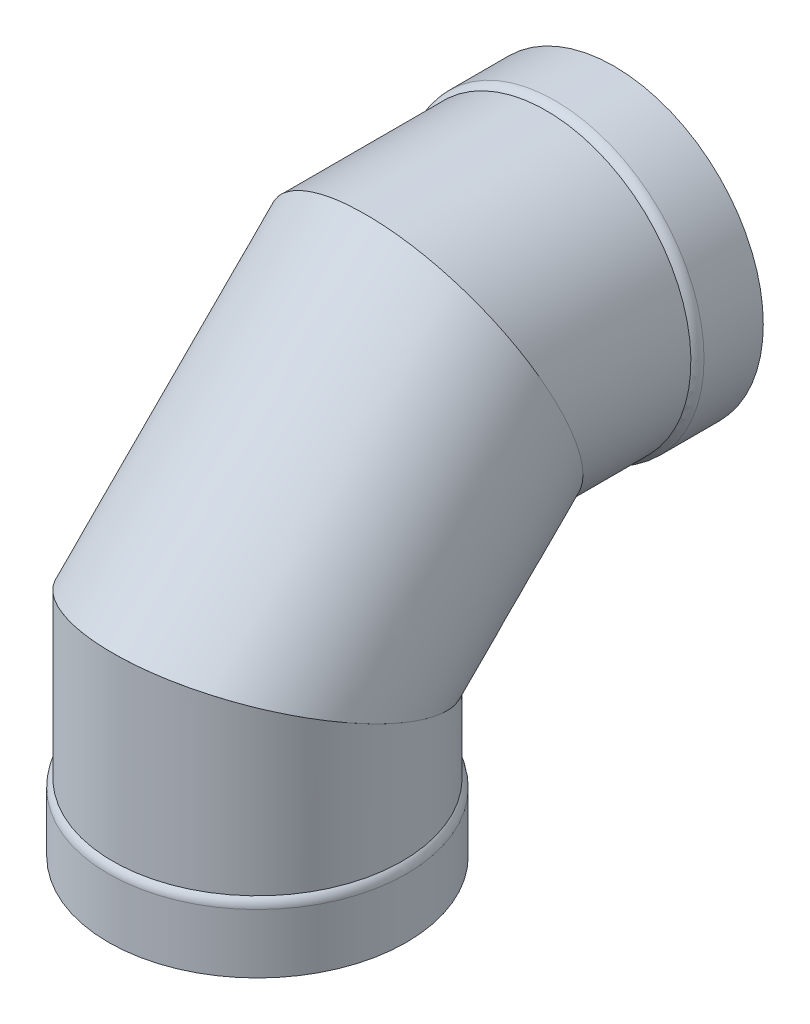
ISO-10303-21;
HEADER;
FILE_DESCRIPTION(('STEP AP214'),'2;1');
FILE_NAME('part.step','',(''),(''),'','','');
FILE_SCHEMA(('AUTOMOTIVE_DESIGN { 1 0 10303 214 1 1 1 1 }'));
ENDSEC;
DATA;
#1=APPLICATION_CONTEXT('core data for automotive mechanical design processes');
#2=APPLICATION_PROTOCOL_DEFINITION('international standard','automotive_design',2000,#1);
#3=PRODUCT_CONTEXT('',#1,'mechanical');
#4=PRODUCT('Part','Part','',(#3));
#5=PRODUCT_RELATED_PRODUCT_CATEGORY('part','',(#4));
#6=PRODUCT_DEFINITION_FORMATION('','',#4);
#7=PRODUCT_DEFINITION_CONTEXT('part definition',#1,'design');
#8=PRODUCT_DEFINITION('design','',#6,#7);
#9=PRODUCT_DEFINITION_SHAPE('','',#8);
#10=(LENGTH_UNIT() NAMED_UNIT(*) SI_UNIT(.MILLI.,.METRE.));
#11=(NAMED_UNIT(*) PLANE_ANGLE_UNIT() SI_UNIT($,.RADIAN.));
#12=(NAMED_UNIT(*) SI_UNIT($,.STERADIAN.) SOLID_ANGLE_UNIT());
#13=UNCERTAINTY_MEASURE_WITH_UNIT(LENGTH_MEASURE(1.E-05),#10,'distance_accuracy_value','');
#14=(GEOMETRIC_REPRESENTATION_CONTEXT(3) GLOBAL_UNCERTAINTY_ASSIGNED_CONTEXT((#13)) GLOBAL_UNIT_ASSIGNED_CONTEXT((#10,
#11,#12)) REPRESENTATION_CONTEXT('',''));
#15=CARTESIAN_POINT('',(0.,0.,0.));
#16=DIRECTION('',(0.,0.,1.));
#17=DIRECTION('',(1.,0.,0.));
#18=AXIS2_PLACEMENT_3D('',#15,#16,#17);
#19=CARTESIAN_POINT('',(0.,399.091863905325,-188.748113905325));
#20=DIRECTION('',(0.,-0.384615384615388,0.923076923076921));
#21=DIRECTION('',(0.,-0.923076923076921,-0.384615384615388));
#22=AXIS2_PLACEMENT_3D('',#19,#20,#21);
#23=PLANE('',#22);
#24=CARTESIAN_POINT('',(0.,399.091863905325,-188.748113905325));
#25=DIRECTION('',(0.,-0.384615384615388,0.923076923076921));
#26=DIRECTION('',(0.,-0.923076923076921,-0.384615384615388));
#27=AXIS2_PLACEMENT_3D('',#24,#25,#26);
#28=ELLIPSE('',#27,170.259375,157.1625);
#29=CARTESIAN_POINT('',(0.,241.929363905326,-254.232488905325));
#30=VERTEX_POINT('',#29);
#31=EDGE_CURVE('E91',#30,#30,#28,.T.);
#32=ORIENTED_EDGE('',*,*,#31,.T.);
#33=EDGE_LOOP('',(#32));
#34=FACE_BOUND('',#33,.T.);
#35=CARTESIAN_POINT('',(0.,399.091863905325,-188.748113905325));
#36=DIRECTION('',(0.,-0.384615384615388,0.923076923076921));
#37=DIRECTION('',(0.,-0.923076923076921,-0.384615384615388));
#38=AXIS2_PLACEMENT_3D('',#35,#36,#37);
#39=ELLIPSE('',#38,175.41875,161.925);
#40=CARTESIAN_POINT('',(0.,237.166863905326,-256.216863905325));
#41=VERTEX_POINT('',#40);
#42=EDGE_CURVE('E12',#41,#41,#39,.T.);
#43=ORIENTED_EDGE('',*,*,#42,.F.);
#44=EDGE_LOOP('',(#43));
#45=FACE_BOUND('',#44,.T.);
#46=ADVANCED_FACE('F74',(#34,#45),#23,.F.);
#47=CARTESIAN_POINT('',(0.,210.34375,0.));
#48=DIRECTION('',(0.,0.923076923076923,-0.384615384615385));
#49=DIRECTION('',(0.,0.384615384615385,0.923076923076923));
#50=AXIS2_PLACEMENT_3D('',#47,#48,#49);
#51=PLANE('',#50);
#52=CARTESIAN_POINT('',(0.,210.34375,0.));
#53=DIRECTION('',(0.,0.923076923076923,-0.384615384615385));
#54=DIRECTION('',(0.,-0.384615384615385,-0.923076923076923));
#55=AXIS2_PLACEMENT_3D('',#52,#53,#54);
#56=ELLIPSE('',#55,170.259375,157.1625);
#57=CARTESIAN_POINT('',(0.,144.859375,-157.1625));
#58=VERTEX_POINT('',#57);
#59=EDGE_CURVE('E105',#58,#58,#56,.T.);
#60=ORIENTED_EDGE('',*,*,#59,.T.);
#61=EDGE_LOOP('',(#60));
#62=FACE_BOUND('',#61,.T.);
#63=CARTESIAN_POINT('',(0.,210.34375,0.));
#64=DIRECTION('',(0.,0.923076923076923,-0.384615384615385));
#65=DIRECTION('',(0.,-0.384615384615385,-0.923076923076923));
#66=AXIS2_PLACEMENT_3D('',#63,#64,#65);
#67=ELLIPSE('',#66,175.41875,161.925);
#68=CARTESIAN_POINT('',(0.,142.875,-161.925));
#69=VERTEX_POINT('',#68);
#70=EDGE_CURVE('E83',#69,#69,#67,.T.);
#71=ORIENTED_EDGE('',*,*,#70,.F.);
#72=EDGE_LOOP('',(#71));
#73=FACE_BOUND('',#72,.T.);
#74=ADVANCED_FACE('F113',(#62,#73),#51,.F.);
#75=CARTESIAN_POINT('',(0.0202913043601244,277.812499470258,161.924998728618));
#76=CARTESIAN_POINT('',(0.0652137582658417,561.016850773213,-121.279369377037));
#77=CARTESIAN_POINT('',(323.870288761596,277.795590049958,161.884416119898));
#78=CARTESIAN_POINT('',(323.915187494042,560.886423256681,-121.333714175592));
#79=CARTESIAN_POINT('',(323.829706152876,142.858091109442,-161.965581337339));
#80=CARTESIAN_POINT('',(323.78475997751,237.036449520906,-256.271203232167));
#81=CARTESIAN_POINT('',(-0.0202913043602162,142.875000529742,-161.924998728618));
#82=CARTESIAN_POINT('',(-0.0652137582658615,237.166877037437,-256.216858433612));
#83=CARTESIAN_POINT('',(-323.870288761596,142.891909950043,-161.884416119898));
#84=CARTESIAN_POINT('',(-323.915187494042,237.297304553969,-256.162513635057));
#85=CARTESIAN_POINT('',(-323.829706152876,277.829408890558,161.965581337338));
#86=CARTESIAN_POINT('',(-323.78475997751,561.147278289745,-121.225024578482));
#87=CARTESIAN_POINT('',(0.0202913043601244,277.812499470258,161.924998728618));
#88=CARTESIAN_POINT('',(0.0652137582658417,561.016850773213,-121.279369377037));
#89=(BOUNDED_SURFACE() B_SPLINE_SURFACE(3,1,((#75,#76),(#77,#78),(#79,#80),(#81,#82),(#83,#84),
(#85,#86),(#87,#88)),.UNSPECIFIED.,.T.,.F.,.F.) B_SPLINE_SURFACE_WITH_KNOTS((4,3,4),(2,2),(0.,
0.5,1.),(0.,1.),.UNSPECIFIED.) GEOMETRIC_REPRESENTATION_ITEM() RATIONAL_B_SPLINE_SURFACE(((1.,
1.),(0.333333333333333,0.333333333333333),(0.333333333333333,0.333333333333333),(1.,1.),
(0.333333333333333,0.333333333333333),(0.333333333333333,0.333333333333333),(1.,1.))) REPRESENTATION_ITEM('') SURFACE());
#90=ORIENTED_EDGE('',*,*,#70,.T.);
#91=EDGE_LOOP('',(#90));
#92=FACE_BOUND('',#91,.T.);
#93=ORIENTED_EDGE('',*,*,#42,.T.);
#94=EDGE_LOOP('',(#93));
#95=FACE_BOUND('',#94,.T.);
#96=ADVANCED_FACE('F133',(#92,#95),#89,.T.);
#97=CARTESIAN_POINT('',(0.,144.859375,-157.1625));
#98=CARTESIAN_POINT('',(0.,241.929363905326,-254.232488905325));
#99=CARTESIAN_POINT('',(-314.325,144.859375,-157.1625));
#100=CARTESIAN_POINT('',(-314.325,241.929363905326,-254.232488905325));
#101=CARTESIAN_POINT('',(-314.325,275.828125,157.1625));
#102=CARTESIAN_POINT('',(-314.325,556.254363905325,-123.263738905324));
#103=CARTESIAN_POINT('',(0.,275.828125,157.1625));
#104=CARTESIAN_POINT('',(0.,556.254363905325,-123.263738905324));
#105=CARTESIAN_POINT('',(314.325,275.828125,157.1625));
#106=CARTESIAN_POINT('',(314.325,556.254363905325,-123.263738905324));
#107=CARTESIAN_POINT('',(314.325,144.859375,-157.1625));
#108=CARTESIAN_POINT('',(314.325,241.929363905326,-254.232488905325));
#109=CARTESIAN_POINT('',(0.,144.859375,-157.1625));
#110=CARTESIAN_POINT('',(0.,241.929363905326,-254.232488905325));
#111=(BOUNDED_SURFACE() B_SPLINE_SURFACE(3,1,((#97,#98),(#99,#100),(#101,#102),(#103,#104),
(#105,#106),(#107,#108),(#109,#110)),.UNSPECIFIED.,.T.,.F.,.F.) B_SPLINE_SURFACE_WITH_KNOTS((4,
3,4),(2,2),(0.,0.5,1.),(0.,1.),
.UNSPECIFIED.) GEOMETRIC_REPRESENTATION_ITEM() RATIONAL_B_SPLINE_SURFACE(((1.,1.),
(0.333333333333333,0.333333333333333),(0.333333333333333,0.333333333333333),(1.,1.),
(0.333333333333333,0.333333333333333),(0.333333333333333,0.333333333333333),(1.,1.))) REPRESENTATION_ITEM('') SURFACE());
#112=ORIENTED_EDGE('',*,*,#59,.F.);
#113=EDGE_LOOP('',(#112));
#114=FACE_BOUND('',#113,.T.);
#115=ORIENTED_EDGE('',*,*,#31,.F.);
#116=EDGE_LOOP('',(#115));
#117=FACE_BOUND('',#116,.T.);
#118=ADVANCED_FACE('F134',(#114,#117),#111,.F.);
#119=CLOSED_SHELL('',(#46,#74,#96,#118));
#120=MANIFOLD_SOLID_BREP('B2',#119);
#121=CARTESIAN_POINT('',(0.,399.091863905326,-451.205657008773));
#122=DIRECTION('',(0.,0.,-1.));
#123=DIRECTION('',(0.,-1.,0.));
#124=AXIS2_PLACEMENT_3D('',#121,#122,#123);
#125=CYLINDRICAL_SURFACE('',#124,161.925);
#126=CARTESIAN_POINT('',(0.,399.091863905326,-322.891863905325));
#127=DIRECTION('',(0.,0.,1.));
#128=DIRECTION('',(0.,-1.,0.));
#129=AXIS2_PLACEMENT_3D('',#126,#127,#128);
#130=CIRCLE('',#129,161.925);
#131=CARTESIAN_POINT('',(0.,237.166863905326,-322.891863905325));
#132=VERTEX_POINT('',#131);
#133=EDGE_CURVE('E275',#132,#132,#130,.T.);
#134=ORIENTED_EDGE('',*,*,#133,.T.);
#135=EDGE_LOOP('',(#134));
#136=FACE_BOUND('',#135,.T.);
#137=CARTESIAN_POINT('',(0.,399.091863905325,-188.748113905325));
#138=DIRECTION('',(0.,-0.384615384615388,0.923076923076922));
#139=DIRECTION('',(0.,-0.923076923076921,-0.384615384615388));
#140=AXIS2_PLACEMENT_3D('',#137,#138,#139);
#141=ELLIPSE('',#140,175.41875,161.925);
#142=CARTESIAN_POINT('',(0.,237.166863905326,-256.216863905325));
#143=VERTEX_POINT('',#142);
#144=EDGE_CURVE('E287',#143,#143,#141,.T.);
#145=ORIENTED_EDGE('',*,*,#144,.F.);
#146=EDGE_LOOP('',(#145));
#147=FACE_BOUND('',#146,.T.);
#148=ADVANCED_FACE('F261',(#136,#147),#125,.T.);
#149=CARTESIAN_POINT('',(0.,399.091863905326,-451.205657008773));
#150=DIRECTION('',(0.,0.,-1.));
#151=DIRECTION('',(0.,-1.,0.));
#152=AXIS2_PLACEMENT_3D('',#149,#150,#151);
#153=CYLINDRICAL_SURFACE('',#152,166.6875);
#154=CARTESIAN_POINT('',(0.,399.091863905326,-332.805798227782));
#155=DIRECTION('',(0.,0.,1.));
#156=DIRECTION('',(0.,-1.,0.));
#157=AXIS2_PLACEMENT_3D('',#154,#155,#156);
#158=CIRCLE('',#157,166.6875);
#159=CARTESIAN_POINT('',(0.,232.404363905326,-332.805798227783));
#160=VERTEX_POINT('',#159);
#161=EDGE_CURVE('E269',#160,#160,#158,.F.);
#162=ORIENTED_EDGE('',*,*,#161,.T.);
#163=EDGE_LOOP('',(#162));
#164=FACE_BOUND('',#163,.T.);
#165=CARTESIAN_POINT('',(0.,399.091863905326,-399.091863905325));
#166=DIRECTION('',(0.,0.,1.));
#167=DIRECTION('',(0.,-1.,0.));
#168=AXIS2_PLACEMENT_3D('',#165,#166,#167);
#169=CIRCLE('',#168,166.6875);
#170=CARTESIAN_POINT('',(0.,232.404363905326,-399.091863905325));
#171=VERTEX_POINT('',#170);
#172=EDGE_CURVE('E281',#171,#171,#169,.T.);
#173=ORIENTED_EDGE('',*,*,#172,.T.);
#174=EDGE_LOOP('',(#173));
#175=FACE_BOUND('',#174,.T.);
#176=ADVANCED_FACE('F308',(#164,#175),#153,.T.);
#177=CARTESIAN_POINT('',(0.,565.779363905326,-399.091863905324));
#178=DIRECTION('',(0.,0.,1.));
#179=DIRECTION('',(0.,1.,0.));
#180=AXIS2_PLACEMENT_3D('',#177,#178,#179);
#181=PLANE('',#180);
#182=CARTESIAN_POINT('',(0.,399.091863905326,-399.091863905325));
#183=DIRECTION('',(0.,0.,1.));
#184=DIRECTION('',(0.,-1.,0.));
#185=AXIS2_PLACEMENT_3D('',#182,#183,#184);
#186=CIRCLE('',#185,161.925);
#187=CARTESIAN_POINT('',(0.,237.166863905326,-399.091863905325));
#188=VERTEX_POINT('',#187);
#189=EDGE_CURVE('E292',#188,#188,#186,.T.);
#190=ORIENTED_EDGE('',*,*,#189,.T.);
#191=EDGE_LOOP('',(#190));
#192=FACE_BOUND('',#191,.T.);
#193=ORIENTED_EDGE('',*,*,#172,.F.);
#194=EDGE_LOOP('',(#193));
#195=FACE_BOUND('',#194,.T.);
#196=ADVANCED_FACE('F314',(#192,#195),#181,.F.);
#197=CARTESIAN_POINT('',(0.,399.091863905326,-451.205657008773));
#198=DIRECTION('',(0.,0.,-1.));
#199=DIRECTION('',(0.,-1.,0.));
#200=AXIS2_PLACEMENT_3D('',#197,#198,#199);
#201=CYLINDRICAL_SURFACE('',#200,161.925);
#202=CARTESIAN_POINT('',(0.,399.091863905326,-337.568298227782));
#203=DIRECTION('',(0.,0.,1.));
#204=DIRECTION('',(0.,-1.,0.));
#205=AXIS2_PLACEMENT_3D('',#202,#203,#204);
#206=CIRCLE('',#205,161.925);
#207=CARTESIAN_POINT('',(0.,237.166863905326,-337.568298227783));
#208=VERTEX_POINT('',#207);
#209=EDGE_CURVE('E73',#208,#208,#206,.T.);
#210=ORIENTED_EDGE('',*,*,#209,.T.);
#211=EDGE_LOOP('',(#210));
#212=FACE_BOUND('',#211,.T.);
#213=ORIENTED_EDGE('',*,*,#189,.F.);
#214=EDGE_LOOP('',(#213));
#215=FACE_BOUND('',#214,.T.);
#216=ADVANCED_FACE('F333',(#212,#215),#201,.F.);
#217=CARTESIAN_POINT('',(0.,399.091863905326,-451.205657008773));
#218=DIRECTION('',(0.,0.,-1.));
#219=DIRECTION('',(0.,-1.,0.));
#220=AXIS2_PLACEMENT_3D('',#217,#218,#219);
#221=CYLINDRICAL_SURFACE('',#220,157.1625);
#222=CARTESIAN_POINT('',(0.,399.091863905325,-188.748113905325));
#223=DIRECTION('',(0.,-0.384615384615388,0.923076923076922));
#224=DIRECTION('',(0.,-0.923076923076921,-0.384615384615388));
#225=AXIS2_PLACEMENT_3D('',#222,#223,#224);
#226=ELLIPSE('',#225,170.259375,157.1625);
#227=CARTESIAN_POINT('',(0.,241.929363905326,-254.232488905325));
#228=VERTEX_POINT('',#227);
#229=EDGE_CURVE('E284',#228,#228,#226,.F.);
#230=ORIENTED_EDGE('',*,*,#229,.F.);
#231=EDGE_LOOP('',(#230));
#232=FACE_BOUND('',#231,.T.);
#233=CARTESIAN_POINT('',(0.,399.091863905326,-327.654363905325));
#234=DIRECTION('',(0.,0.,1.));
#235=DIRECTION('',(0.,-1.,0.));
#236=AXIS2_PLACEMENT_3D('',#233,#234,#235);
#237=CIRCLE('',#236,157.1625);
#238=CARTESIAN_POINT('',(0.,241.929363905326,-327.654363905325));
#239=VERTEX_POINT('',#238);
#240=EDGE_CURVE('E296',#239,#239,#237,.T.);
#241=ORIENTED_EDGE('',*,*,#240,.F.);
#242=EDGE_LOOP('',(#241));
#243=FACE_BOUND('',#242,.T.);
#244=ADVANCED_FACE('F325',(#232,#243),#221,.F.);
#245=CARTESIAN_POINT('',(-166.6875,561.016863905325,-121.279363905324));
#246=DIRECTION('',(0.,0.384615384615388,-0.923076923076922));
#247=DIRECTION('',(0.,-0.923076923076921,-0.384615384615388));
#248=AXIS2_PLACEMENT_3D('',#245,#246,#247);
#249=PLANE('',#248);
#250=ORIENTED_EDGE('',*,*,#229,.T.);
#251=EDGE_LOOP('',(#250));
#252=FACE_BOUND('',#251,.T.);
#253=ORIENTED_EDGE('',*,*,#144,.T.);
#254=EDGE_LOOP('',(#253));
#255=FACE_BOUND('',#254,.T.);
#256=ADVANCED_FACE('F305',(#252,#255),#249,.F.);
#257=CARTESIAN_POINT('',(0.,399.091863905326,-332.805798227782));
#258=DIRECTION('',(0.,0.,1.));
#259=DIRECTION('',(0.,-1.,0.));
#260=AXIS2_PLACEMENT_3D('',#257,#258,#259);
#261=TOROIDAL_SURFACE('',#260,153.9875,12.7);
#262=ORIENTED_EDGE('',*,*,#161,.F.);
#263=EDGE_LOOP('',(#262));
#264=FACE_BOUND('',#263,.T.);
#265=ORIENTED_EDGE('',*,*,#133,.F.);
#266=EDGE_LOOP('',(#265));
#267=FACE_BOUND('',#266,.T.);
#268=ADVANCED_FACE('F317',(#264,#267),#261,.T.);
#269=CARTESIAN_POINT('',(0.,399.091863905326,-337.568298227782));
#270=DIRECTION('',(0.,0.,1.));
#271=DIRECTION('',(0.,-1.,0.));
#272=AXIS2_PLACEMENT_3D('',#269,#270,#271);
#273=TOROIDAL_SURFACE('',#272,149.225,12.7);
#274=ORIENTED_EDGE('',*,*,#240,.T.);
#275=EDGE_LOOP('',(#274));
#276=FACE_BOUND('',#275,.T.);
#277=ORIENTED_EDGE('',*,*,#209,.F.);
#278=EDGE_LOOP('',(#277));
#279=FACE_BOUND('',#278,.T.);
#280=ADVANCED_FACE('F263',(#276,#279),#273,.F.);
#281=CLOSED_SHELL('',(#148,#176,#196,#216,#244,#256,#268,#280));
#282=MANIFOLD_SOLID_BREP('B7',#281);
#283=CARTESIAN_POINT('',(0.,-52.1137931034483,0.));
#284=DIRECTION('',(0.,-1.,0.));
#285=DIRECTION('',(0.,0.,-1.));
#286=AXIS2_PLACEMENT_3D('',#283,#284,#285);
#287=CYLINDRICAL_SURFACE('',#286,161.925);
#288=CARTESIAN_POINT('',(0.,76.2,0.));
#289=DIRECTION('',(0.,-1.,0.));
#290=DIRECTION('',(0.,0.,-1.));
#291=AXIS2_PLACEMENT_3D('',#288,#289,#290);
#292=CIRCLE('',#291,161.925);
#293=CARTESIAN_POINT('',(0.,76.2,-161.925));
#294=VERTEX_POINT('',#293);
#295=EDGE_CURVE('E429',#294,#294,#292,.T.);
#296=ORIENTED_EDGE('',*,*,#295,.F.);
#297=EDGE_LOOP('',(#296));
#298=FACE_BOUND('',#297,.T.);
#299=CARTESIAN_POINT('',(0.,210.34375,0.));
#300=DIRECTION('',(0.,-0.923076923076923,0.384615384615385));
#301=DIRECTION('',(0.,-0.384615384615385,-0.923076923076923));
#302=AXIS2_PLACEMENT_3D('',#299,#300,#301);
#303=ELLIPSE('',#302,175.41875,161.925);
#304=CARTESIAN_POINT('',(0.,142.875,-161.925));
#305=VERTEX_POINT('',#304);
#306=EDGE_CURVE('E441',#305,#305,#303,.T.);
#307=ORIENTED_EDGE('',*,*,#306,.T.);
#308=EDGE_LOOP('',(#307));
#309=FACE_BOUND('',#308,.T.);
#310=ADVANCED_FACE('F415',(#298,#309),#287,.T.);
#311=CARTESIAN_POINT('',(0.,-52.1137931034483,0.));
#312=DIRECTION('',(0.,-1.,0.));
#313=DIRECTION('',(0.,0.,-1.));
#314=AXIS2_PLACEMENT_3D('',#311,#312,#313);
#315=CYLINDRICAL_SURFACE('',#314,166.6875);
#316=CARTESIAN_POINT('',(0.,66.2860656775425,0.));
#317=DIRECTION('',(0.,1.,0.));
#318=DIRECTION('',(0.,0.,1.));
#319=AXIS2_PLACEMENT_3D('',#316,#317,#318);
#320=CIRCLE('',#319,166.6875);
#321=CARTESIAN_POINT('',(0.,66.2860656775425,166.6875));
#322=VERTEX_POINT('',#321);
#323=EDGE_CURVE('E260',#322,#322,#320,.F.);
#324=ORIENTED_EDGE('',*,*,#323,.T.);
#325=EDGE_LOOP('',(#324));
#326=FACE_BOUND('',#325,.T.);
#327=CARTESIAN_POINT('',(0.,0.,0.));
#328=DIRECTION('',(0.,-1.,0.));
#329=DIRECTION('',(0.,0.,-1.));
#330=AXIS2_PLACEMENT_3D('',#327,#328,#329);
#331=CIRCLE('',#330,166.6875);
#332=CARTESIAN_POINT('',(0.,0.,-166.6875));
#333=VERTEX_POINT('',#332);
#334=EDGE_CURVE('E435',#333,#333,#331,.T.);
#335=ORIENTED_EDGE('',*,*,#334,.F.);
#336=EDGE_LOOP('',(#335));
#337=FACE_BOUND('',#336,.T.);
#338=ADVANCED_FACE('F476',(#326,#337),#315,.T.);
#339=CARTESIAN_POINT('',(0.,0.,166.6875));
#340=DIRECTION('',(0.,1.,0.));
#341=DIRECTION('',(0.,0.,1.));
#342=AXIS2_PLACEMENT_3D('',#339,#340,#341);
#343=PLANE('',#342);
#344=CARTESIAN_POINT('',(0.,0.,0.));
#345=DIRECTION('',(0.,-1.,0.));
#346=DIRECTION('',(0.,0.,-1.));
#347=AXIS2_PLACEMENT_3D('',#344,#345,#346);
#348=CIRCLE('',#347,161.925);
#349=CARTESIAN_POINT('',(0.,0.,-161.925));
#350=VERTEX_POINT('',#349);
#351=EDGE_CURVE('E446',#350,#350,#348,.T.);
#352=ORIENTED_EDGE('',*,*,#351,.F.);
#353=EDGE_LOOP('',(#352));
#354=FACE_BOUND('',#353,.T.);
#355=ORIENTED_EDGE('',*,*,#334,.T.);
#356=EDGE_LOOP('',(#355));
#357=FACE_BOUND('',#356,.T.);
#358=ADVANCED_FACE('F482',(#354,#357),#343,.F.);
#359=CARTESIAN_POINT('',(0.,-52.1137931034483,0.));
#360=DIRECTION('',(0.,-1.,0.));
#361=DIRECTION('',(0.,0.,-1.));
#362=AXIS2_PLACEMENT_3D('',#359,#360,#361);
#363=CYLINDRICAL_SURFACE('',#362,161.925);
#364=CARTESIAN_POINT('',(0.,61.5235656775425,0.));
#365=DIRECTION('',(0.,1.,0.));
#366=DIRECTION('',(0.,0.,1.));
#367=AXIS2_PLACEMENT_3D('',#364,#365,#366);
#368=CIRCLE('',#367,161.925);
#369=CARTESIAN_POINT('',(0.,61.5235656775425,161.925));
#370=VERTEX_POINT('',#369);
#371=EDGE_CURVE('E423',#370,#370,#368,.T.);
#372=ORIENTED_EDGE('',*,*,#371,.T.);
#373=EDGE_LOOP('',(#372));
#374=FACE_BOUND('',#373,.T.);
#375=ORIENTED_EDGE('',*,*,#351,.T.);
#376=EDGE_LOOP('',(#375));
#377=FACE_BOUND('',#376,.T.);
#378=ADVANCED_FACE('F471',(#374,#377),#363,.F.);
#379=CARTESIAN_POINT('',(0.,-52.1137931034483,0.));
#380=DIRECTION('',(0.,-1.,0.));
#381=DIRECTION('',(0.,0.,-1.));
#382=AXIS2_PLACEMENT_3D('',#379,#380,#381);
#383=CYLINDRICAL_SURFACE('',#382,157.1625);
#384=CARTESIAN_POINT('',(0.,210.34375,0.));
#385=DIRECTION('',(0.,-0.923076923076923,0.384615384615385));
#386=DIRECTION('',(0.,-0.384615384615385,-0.923076923076923));
#387=AXIS2_PLACEMENT_3D('',#384,#385,#386);
#388=ELLIPSE('',#387,170.259375,157.1625);
#389=CARTESIAN_POINT('',(0.,144.859375,-157.1625));
#390=VERTEX_POINT('',#389);
#391=EDGE_CURVE('E438',#390,#390,#388,.F.);
#392=ORIENTED_EDGE('',*,*,#391,.T.);
#393=EDGE_LOOP('',(#392));
#394=FACE_BOUND('',#393,.T.);
#395=CARTESIAN_POINT('',(0.,71.4375,0.));
#396=DIRECTION('',(0.,-1.,0.));
#397=DIRECTION('',(0.,0.,-1.));
#398=AXIS2_PLACEMENT_3D('',#395,#396,#397);
#399=CIRCLE('',#398,157.1625);
#400=CARTESIAN_POINT('',(0.,71.4375,-157.1625));
#401=VERTEX_POINT('',#400);
#402=EDGE_CURVE('E450',#401,#401,#399,.T.);
#403=ORIENTED_EDGE('',*,*,#402,.T.);
#404=EDGE_LOOP('',(#403));
#405=FACE_BOUND('',#404,.T.);
#406=ADVANCED_FACE('F463',(#394,#405),#383,.F.);
#407=CARTESIAN_POINT('',(-166.6875,277.8125,161.925));
#408=DIRECTION('',(0.,-0.923076923076923,0.384615384615385));
#409=DIRECTION('',(0.,-0.384615384615385,-0.923076923076923));
#410=AXIS2_PLACEMENT_3D('',#407,#408,#409);
#411=PLANE('',#410);
#412=ORIENTED_EDGE('',*,*,#391,.F.);
#413=EDGE_LOOP('',(#412));
#414=FACE_BOUND('',#413,.T.);
#415=ORIENTED_EDGE('',*,*,#306,.F.);
#416=EDGE_LOOP('',(#415));
#417=FACE_BOUND('',#416,.T.);
#418=ADVANCED_FACE('F460',(#414,#417),#411,.F.);
#419=CARTESIAN_POINT('',(0.,61.5235656775425,0.));
#420=DIRECTION('',(0.,1.,0.));
#421=DIRECTION('',(0.,0.,1.));
#422=AXIS2_PLACEMENT_3D('',#419,#420,#421);
#423=TOROIDAL_SURFACE('',#422,149.225,12.7);
#424=ORIENTED_EDGE('',*,*,#371,.F.);
#425=EDGE_LOOP('',(#424));
#426=FACE_BOUND('',#425,.T.);
#427=ORIENTED_EDGE('',*,*,#402,.F.);
#428=EDGE_LOOP('',(#427));
#429=FACE_BOUND('',#428,.T.);
#430=ADVANCED_FACE('F462',(#426,#429),#423,.F.);
#431=CARTESIAN_POINT('',(0.,66.2860656775425,0.));
#432=DIRECTION('',(0.,1.,0.));
#433=DIRECTION('',(0.,0.,1.));
#434=AXIS2_PLACEMENT_3D('',#431,#432,#433);
#435=TOROIDAL_SURFACE('',#434,153.9875,12.7);
#436=ORIENTED_EDGE('',*,*,#295,.T.);
#437=EDGE_LOOP('',(#436));
#438=FACE_BOUND('',#437,.T.);
#439=ORIENTED_EDGE('',*,*,#323,.F.);
#440=EDGE_LOOP('',(#439));
#441=FACE_BOUND('',#440,.T.);
#442=ADVANCED_FACE('F417',(#438,#441),#435,.T.);
#443=CLOSED_SHELL('',(#310,#338,#358,#378,#406,#418,#430,#442));
#444=MANIFOLD_SOLID_BREP('B68',#443);
#445=ADVANCED_BREP_SHAPE_REPRESENTATION('',(#18,#120,#282,#444),#14);
#446=SHAPE_DEFINITION_REPRESENTATION(#9,#445);
ENDSEC;
END-ISO-10303-21;
